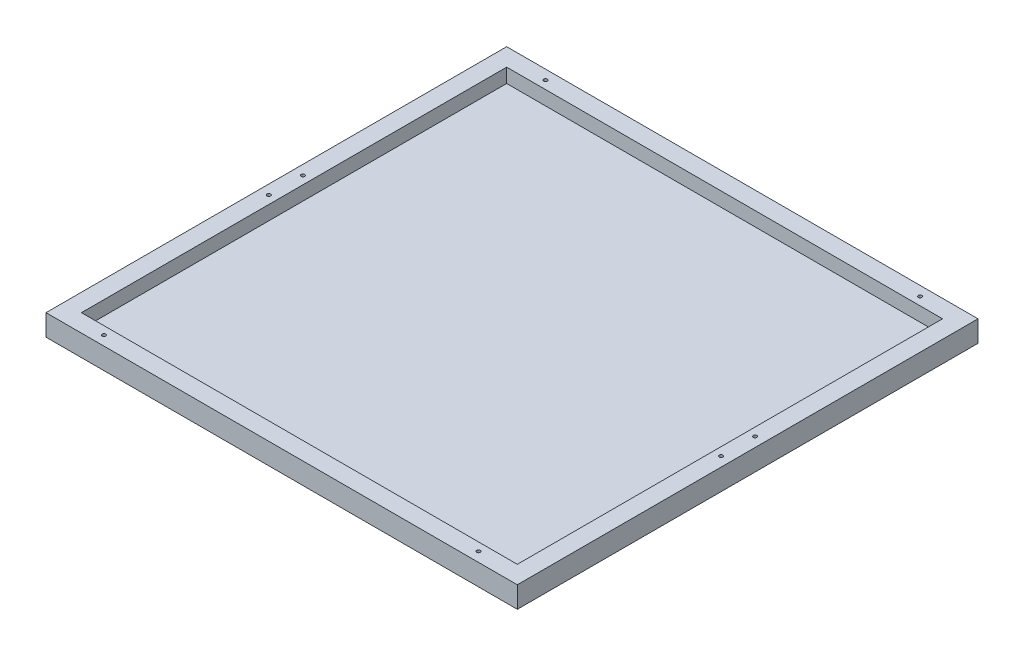
ISO-10303-21;
HEADER;
FILE_DESCRIPTION(('STEP AP214'),'2;1');
FILE_NAME('part.step','',(''),(''),'','','');
FILE_SCHEMA(('AUTOMOTIVE_DESIGN { 1 0 10303 214 1 1 1 1 }'));
ENDSEC;
DATA;
#1=APPLICATION_CONTEXT('core data for automotive mechanical design processes');
#2=APPLICATION_PROTOCOL_DEFINITION('international standard','automotive_design',2000,#1);
#3=PRODUCT_CONTEXT('',#1,'mechanical');
#4=PRODUCT('Part','Part','',(#3));
#5=PRODUCT_RELATED_PRODUCT_CATEGORY('part','',(#4));
#6=PRODUCT_DEFINITION_FORMATION('','',#4);
#7=PRODUCT_DEFINITION_CONTEXT('part definition',#1,'design');
#8=PRODUCT_DEFINITION('design','',#6,#7);
#9=PRODUCT_DEFINITION_SHAPE('','',#8);
#10=(LENGTH_UNIT() NAMED_UNIT(*) SI_UNIT(.MILLI.,.METRE.));
#11=(NAMED_UNIT(*) PLANE_ANGLE_UNIT() SI_UNIT($,.RADIAN.));
#12=(NAMED_UNIT(*) SI_UNIT($,.STERADIAN.) SOLID_ANGLE_UNIT());
#13=UNCERTAINTY_MEASURE_WITH_UNIT(LENGTH_MEASURE(1.E-05),#10,'distance_accuracy_value','');
#14=(GEOMETRIC_REPRESENTATION_CONTEXT(3) GLOBAL_UNCERTAINTY_ASSIGNED_CONTEXT((#13)) GLOBAL_UNIT_ASSIGNED_CONTEXT((#10,
#11,#12)) REPRESENTATION_CONTEXT('',''));
#15=CARTESIAN_POINT('',(0.,0.,0.));
#16=DIRECTION('',(0.,0.,1.));
#17=DIRECTION('',(1.,0.,0.));
#18=AXIS2_PLACEMENT_3D('',#15,#16,#17);
#19=CARTESIAN_POINT('',(0.,-30.,0.));
#20=DIRECTION('',(-1.,0.,0.));
#21=DIRECTION('',(0.,0.,1.));
#22=AXIS2_PLACEMENT_3D('',#19,#20,#21);
#23=PLANE('',#22);
#24=DIRECTION('',(0.,0.,1.));
#25=VECTOR('',#24,1.);
#26=CARTESIAN_POINT('',(0.,0.,0.));
#27=LINE('',#26,#25);
#28=CARTESIAN_POINT('',(0.,0.,-650.));
#29=VERTEX_POINT('',#28);
#30=CARTESIAN_POINT('',(0.,0.,0.));
#31=VERTEX_POINT('',#30);
#32=EDGE_CURVE('E191',#29,#31,#27,.T.);
#33=ORIENTED_EDGE('',*,*,#32,.F.);
#34=DIRECTION('',(0.,1.,0.));
#35=VECTOR('',#34,1.);
#36=CARTESIAN_POINT('',(0.,-30.,-650.));
#37=LINE('',#36,#35);
#38=CARTESIAN_POINT('',(0.,-30.,-650.));
#39=VERTEX_POINT('',#38);
#40=EDGE_CURVE('E11',#39,#29,#37,.T.);
#41=ORIENTED_EDGE('',*,*,#40,.F.);
#42=DIRECTION('',(0.,0.,1.));
#43=VECTOR('',#42,1.);
#44=CARTESIAN_POINT('',(0.,-30.,0.));
#45=LINE('',#44,#43);
#46=CARTESIAN_POINT('',(0.,-30.,0.));
#47=VERTEX_POINT('',#46);
#48=EDGE_CURVE('E192',#39,#47,#45,.T.);
#49=ORIENTED_EDGE('',*,*,#48,.T.);
#50=DIRECTION('',(0.,1.,0.));
#51=VECTOR('',#50,1.);
#52=CARTESIAN_POINT('',(0.,-30.,0.));
#53=LINE('',#52,#51);
#54=EDGE_CURVE('E36',#47,#31,#53,.T.);
#55=ORIENTED_EDGE('',*,*,#54,.T.);
#56=EDGE_LOOP('',(#33,#41,#49,#55));
#57=FACE_BOUND('',#56,.T.);
#58=ADVANCED_FACE('F33',(#57),#23,.T.);
#59=CARTESIAN_POINT('',(0.,-30.,-650.));
#60=DIRECTION('',(0.,0.,-1.));
#61=DIRECTION('',(-1.,0.,0.));
#62=AXIS2_PLACEMENT_3D('',#59,#60,#61);
#63=PLANE('',#62);
#64=DIRECTION('',(-1.,0.,0.));
#65=VECTOR('',#64,1.);
#66=CARTESIAN_POINT('',(0.,0.,-650.));
#67=LINE('',#66,#65);
#68=CARTESIAN_POINT('',(665.,0.,-650.));
#69=VERTEX_POINT('',#68);
#70=EDGE_CURVE('E195',#69,#29,#67,.T.);
#71=ORIENTED_EDGE('',*,*,#70,.F.);
#72=DIRECTION('',(0.,1.,0.));
#73=VECTOR('',#72,1.);
#74=CARTESIAN_POINT('',(665.,-30.,-650.));
#75=LINE('',#74,#73);
#76=CARTESIAN_POINT('',(665.,-30.,-650.));
#77=VERTEX_POINT('',#76);
#78=EDGE_CURVE('E41',#77,#69,#75,.T.);
#79=ORIENTED_EDGE('',*,*,#78,.F.);
#80=DIRECTION('',(-1.,0.,0.));
#81=VECTOR('',#80,1.);
#82=CARTESIAN_POINT('',(0.,-30.,-650.));
#83=LINE('',#82,#81);
#84=EDGE_CURVE('E200',#77,#39,#83,.T.);
#85=ORIENTED_EDGE('',*,*,#84,.T.);
#86=ORIENTED_EDGE('',*,*,#40,.T.);
#87=EDGE_LOOP('',(#71,#79,#85,#86));
#88=FACE_BOUND('',#87,.T.);
#89=ADVANCED_FACE('F217',(#88),#63,.T.);
#90=CARTESIAN_POINT('',(665.,-30.,0.));
#91=DIRECTION('',(1.,0.,0.));
#92=DIRECTION('',(0.,0.,-1.));
#93=AXIS2_PLACEMENT_3D('',#90,#91,#92);
#94=PLANE('',#93);
#95=DIRECTION('',(0.,0.,-1.));
#96=VECTOR('',#95,1.);
#97=CARTESIAN_POINT('',(665.,0.,0.));
#98=LINE('',#97,#96);
#99=CARTESIAN_POINT('',(665.,0.,0.));
#100=VERTEX_POINT('',#99);
#101=EDGE_CURVE('E207',#100,#69,#98,.T.);
#102=ORIENTED_EDGE('',*,*,#101,.F.);
#103=DIRECTION('',(0.,1.,0.));
#104=VECTOR('',#103,1.);
#105=CARTESIAN_POINT('',(665.,-30.,0.));
#106=LINE('',#105,#104);
#107=CARTESIAN_POINT('',(665.,-30.,0.));
#108=VERTEX_POINT('',#107);
#109=EDGE_CURVE('E212',#108,#100,#106,.T.);
#110=ORIENTED_EDGE('',*,*,#109,.F.);
#111=DIRECTION('',(0.,0.,-1.));
#112=VECTOR('',#111,1.);
#113=CARTESIAN_POINT('',(665.,-30.,0.));
#114=LINE('',#113,#112);
#115=EDGE_CURVE('E197',#108,#77,#114,.T.);
#116=ORIENTED_EDGE('',*,*,#115,.T.);
#117=ORIENTED_EDGE('',*,*,#78,.T.);
#118=EDGE_LOOP('',(#102,#110,#116,#117));
#119=FACE_BOUND('',#118,.T.);
#120=ADVANCED_FACE('F221',(#119),#94,.T.);
#121=CARTESIAN_POINT('',(0.,-30.,0.));
#122=DIRECTION('',(0.,0.,1.));
#123=DIRECTION('',(1.,0.,0.));
#124=AXIS2_PLACEMENT_3D('',#121,#122,#123);
#125=PLANE('',#124);
#126=DIRECTION('',(1.,0.,0.));
#127=VECTOR('',#126,1.);
#128=CARTESIAN_POINT('',(0.,0.,0.));
#129=LINE('',#128,#127);
#130=EDGE_CURVE('E204',#31,#100,#129,.T.);
#131=ORIENTED_EDGE('',*,*,#130,.F.);
#132=ORIENTED_EDGE('',*,*,#54,.F.);
#133=DIRECTION('',(1.,0.,0.));
#134=VECTOR('',#133,1.);
#135=CARTESIAN_POINT('',(0.,-30.,0.));
#136=LINE('',#135,#134);
#137=EDGE_CURVE('E194',#47,#108,#136,.T.);
#138=ORIENTED_EDGE('',*,*,#137,.T.);
#139=ORIENTED_EDGE('',*,*,#109,.T.);
#140=EDGE_LOOP('',(#131,#132,#138,#139));
#141=FACE_BOUND('',#140,.T.);
#142=ADVANCED_FACE('F214',(#141),#125,.T.);
#143=CARTESIAN_POINT('',(0.,-30.,0.));
#144=DIRECTION('',(0.,-1.,0.));
#145=DIRECTION('',(0.,0.,-1.));
#146=AXIS2_PLACEMENT_3D('',#143,#144,#145);
#147=PLANE('',#146);
#148=ORIENTED_EDGE('',*,*,#48,.F.);
#149=ORIENTED_EDGE('',*,*,#84,.F.);
#150=ORIENTED_EDGE('',*,*,#115,.F.);
#151=ORIENTED_EDGE('',*,*,#137,.F.);
#152=EDGE_LOOP('',(#148,#149,#150,#151));
#153=FACE_BOUND('',#152,.T.);
#154=ADVANCED_FACE('F223',(#153),#147,.T.);
#155=CARTESIAN_POINT('',(0.,0.,0.));
#156=DIRECTION('',(0.,-1.,0.));
#157=DIRECTION('',(0.,0.,-1.));
#158=AXIS2_PLACEMENT_3D('',#155,#156,#157);
#159=PLANE('',#158);
#160=DIRECTION('',(1.,0.,0.));
#161=VECTOR('',#160,1.);
#162=CARTESIAN_POINT('',(25.0000000000001,0.,-25.));
#163=LINE('',#162,#161);
#164=CARTESIAN_POINT('',(25.0000000000001,0.,-25.));
#165=VERTEX_POINT('',#164);
#166=CARTESIAN_POINT('',(640.,0.,-25.));
#167=VERTEX_POINT('',#166);
#168=EDGE_CURVE('E134',#165,#167,#163,.T.);
#169=ORIENTED_EDGE('',*,*,#168,.F.);
#170=DIRECTION('',(0.,0.,1.));
#171=VECTOR('',#170,1.);
#172=CARTESIAN_POINT('',(25.,0.,-625.));
#173=LINE('',#172,#171);
#174=CARTESIAN_POINT('',(25.,0.,-625.));
#175=VERTEX_POINT('',#174);
#176=EDGE_CURVE('E49',#175,#165,#173,.T.);
#177=ORIENTED_EDGE('',*,*,#176,.F.);
#178=DIRECTION('',(-1.,0.,0.));
#179=VECTOR('',#178,1.);
#180=CARTESIAN_POINT('',(25.,0.,-625.));
#181=LINE('',#180,#179);
#182=CARTESIAN_POINT('',(640.,0.,-625.));
#183=VERTEX_POINT('',#182);
#184=EDGE_CURVE('E125',#183,#175,#181,.T.);
#185=ORIENTED_EDGE('',*,*,#184,.F.);
#186=DIRECTION('',(0.,0.,-1.));
#187=VECTOR('',#186,1.);
#188=CARTESIAN_POINT('',(640.,0.,-625.));
#189=LINE('',#188,#187);
#190=EDGE_CURVE('E128',#167,#183,#189,.T.);
#191=ORIENTED_EDGE('',*,*,#190,.F.);
#192=EDGE_LOOP('',(#169,#177,#185,#191));
#193=FACE_BOUND('',#192,.T.);
#194=CARTESIAN_POINT('',(68.25,0.,-13.5));
#195=DIRECTION('',(0.,1.,0.));
#196=DIRECTION('',(0.,0.,1.));
#197=AXIS2_PLACEMENT_3D('',#194,#195,#196);
#198=CIRCLE('',#197,2.5273);
#199=CARTESIAN_POINT('',(68.25,0.,-10.9727));
#200=VERTEX_POINT('',#199);
#201=EDGE_CURVE('E140',#200,#200,#198,.T.);
#202=ORIENTED_EDGE('',*,*,#201,.F.);
#203=EDGE_LOOP('',(#202));
#204=FACE_BOUND('',#203,.T.);
#205=CARTESIAN_POINT('',(13.5,0.,-301.));
#206=DIRECTION('',(0.,1.,0.));
#207=DIRECTION('',(0.,0.,1.));
#208=AXIS2_PLACEMENT_3D('',#205,#206,#207);
#209=CIRCLE('',#208,2.5273);
#210=CARTESIAN_POINT('',(13.5,0.,-298.4727));
#211=VERTEX_POINT('',#210);
#212=EDGE_CURVE('E149',#211,#211,#209,.T.);
#213=ORIENTED_EDGE('',*,*,#212,.F.);
#214=EDGE_LOOP('',(#213));
#215=FACE_BOUND('',#214,.T.);
#216=CARTESIAN_POINT('',(596.75,0.,-13.5));
#217=DIRECTION('',(0.,1.,0.));
#218=DIRECTION('',(0.,0.,1.));
#219=AXIS2_PLACEMENT_3D('',#216,#217,#218);
#220=CIRCLE('',#219,2.52730000000001);
#221=CARTESIAN_POINT('',(596.75,0.,-10.9726999999999));
#222=VERTEX_POINT('',#221);
#223=EDGE_CURVE('E155',#222,#222,#220,.T.);
#224=ORIENTED_EDGE('',*,*,#223,.F.);
#225=EDGE_LOOP('',(#224));
#226=FACE_BOUND('',#225,.T.);
#227=CARTESIAN_POINT('',(651.5,0.,-301.));
#228=DIRECTION('',(0.,1.,0.));
#229=DIRECTION('',(0.,0.,1.));
#230=AXIS2_PLACEMENT_3D('',#227,#228,#229);
#231=CIRCLE('',#230,2.52730000000001);
#232=CARTESIAN_POINT('',(651.5,0.,-298.4727));
#233=VERTEX_POINT('',#232);
#234=EDGE_CURVE('E161',#233,#233,#231,.T.);
#235=ORIENTED_EDGE('',*,*,#234,.F.);
#236=EDGE_LOOP('',(#235));
#237=FACE_BOUND('',#236,.T.);
#238=CARTESIAN_POINT('',(651.5,0.,-349.));
#239=DIRECTION('',(0.,1.,0.));
#240=DIRECTION('',(0.,0.,1.));
#241=AXIS2_PLACEMENT_3D('',#238,#239,#240);
#242=CIRCLE('',#241,2.52730000000001);
#243=CARTESIAN_POINT('',(651.5,0.,-346.4727));
#244=VERTEX_POINT('',#243);
#245=EDGE_CURVE('E167',#244,#244,#242,.T.);
#246=ORIENTED_EDGE('',*,*,#245,.F.);
#247=EDGE_LOOP('',(#246));
#248=FACE_BOUND('',#247,.T.);
#249=CARTESIAN_POINT('',(596.75,0.,-636.5));
#250=DIRECTION('',(0.,1.,0.));
#251=DIRECTION('',(0.,0.,1.));
#252=AXIS2_PLACEMENT_3D('',#249,#250,#251);
#253=CIRCLE('',#252,2.52730000000001);
#254=CARTESIAN_POINT('',(596.75,0.,-633.9727));
#255=VERTEX_POINT('',#254);
#256=EDGE_CURVE('E173',#255,#255,#253,.T.);
#257=ORIENTED_EDGE('',*,*,#256,.F.);
#258=EDGE_LOOP('',(#257));
#259=FACE_BOUND('',#258,.T.);
#260=CARTESIAN_POINT('',(68.25,0.,-636.5));
#261=DIRECTION('',(0.,1.,0.));
#262=DIRECTION('',(0.,0.,1.));
#263=AXIS2_PLACEMENT_3D('',#260,#261,#262);
#264=CIRCLE('',#263,2.5273);
#265=CARTESIAN_POINT('',(68.25,0.,-633.9727));
#266=VERTEX_POINT('',#265);
#267=EDGE_CURVE('E179',#266,#266,#264,.T.);
#268=ORIENTED_EDGE('',*,*,#267,.F.);
#269=EDGE_LOOP('',(#268));
#270=FACE_BOUND('',#269,.T.);
#271=CARTESIAN_POINT('',(13.5000000000001,0.,-349.));
#272=DIRECTION('',(0.,1.,0.));
#273=DIRECTION('',(0.,0.,1.));
#274=AXIS2_PLACEMENT_3D('',#271,#272,#273);
#275=CIRCLE('',#274,2.5273);
#276=CARTESIAN_POINT('',(13.5000000000001,0.,-346.4727));
#277=VERTEX_POINT('',#276);
#278=EDGE_CURVE('E185',#277,#277,#275,.T.);
#279=ORIENTED_EDGE('',*,*,#278,.F.);
#280=EDGE_LOOP('',(#279));
#281=FACE_BOUND('',#280,.T.);
#282=ORIENTED_EDGE('',*,*,#32,.T.);
#283=ORIENTED_EDGE('',*,*,#130,.T.);
#284=ORIENTED_EDGE('',*,*,#101,.T.);
#285=ORIENTED_EDGE('',*,*,#70,.T.);
#286=EDGE_LOOP('',(#282,#283,#284,#285));
#287=FACE_BOUND('',#286,.T.);
#288=ADVANCED_FACE('F216',(#193,#204,#215,#226,#237,#248,#259,#270,#281,#287),#159,.F.);
#289=CARTESIAN_POINT('',(13.5000000000001,-9.65,-349.));
#290=DIRECTION('',(0.,-1.,0.));
#291=DIRECTION('',(0.,0.,-1.));
#292=AXIS2_PLACEMENT_3D('',#289,#290,#291);
#293=PLANE('',#292);
#294=CARTESIAN_POINT('',(13.5000000000001,-9.65,-349.));
#295=DIRECTION('',(0.,1.,0.));
#296=DIRECTION('',(0.,0.,1.));
#297=AXIS2_PLACEMENT_3D('',#294,#295,#296);
#298=CIRCLE('',#297,2.5273);
#299=CARTESIAN_POINT('',(13.5000000000001,-9.65,-346.4727));
#300=VERTEX_POINT('',#299);
#301=EDGE_CURVE('E188',#300,#300,#298,.T.);
#302=ORIENTED_EDGE('',*,*,#301,.T.);
#303=EDGE_LOOP('',(#302));
#304=FACE_BOUND('',#303,.T.);
#305=ADVANCED_FACE('F231',(#304),#293,.F.);
#306=CARTESIAN_POINT('',(13.5000000000001,0.,-349.));
#307=DIRECTION('',(0.,1.,0.));
#308=DIRECTION('',(0.,0.,1.));
#309=AXIS2_PLACEMENT_3D('',#306,#307,#308);
#310=CYLINDRICAL_SURFACE('',#309,2.5273);
#311=ORIENTED_EDGE('',*,*,#301,.F.);
#312=EDGE_LOOP('',(#311));
#313=FACE_BOUND('',#312,.T.);
#314=ORIENTED_EDGE('',*,*,#278,.T.);
#315=EDGE_LOOP('',(#314));
#316=FACE_BOUND('',#315,.T.);
#317=ADVANCED_FACE('F264',(#313,#316),#310,.F.);
#318=CARTESIAN_POINT('',(68.25,-9.65,-636.5));
#319=DIRECTION('',(0.,-1.,0.));
#320=DIRECTION('',(0.,0.,-1.));
#321=AXIS2_PLACEMENT_3D('',#318,#319,#320);
#322=PLANE('',#321);
#323=CARTESIAN_POINT('',(68.25,-9.65,-636.5));
#324=DIRECTION('',(0.,1.,0.));
#325=DIRECTION('',(0.,0.,1.));
#326=AXIS2_PLACEMENT_3D('',#323,#324,#325);
#327=CIRCLE('',#326,2.5273);
#328=CARTESIAN_POINT('',(68.25,-9.65,-633.9727));
#329=VERTEX_POINT('',#328);
#330=EDGE_CURVE('E182',#329,#329,#327,.T.);
#331=ORIENTED_EDGE('',*,*,#330,.T.);
#332=EDGE_LOOP('',(#331));
#333=FACE_BOUND('',#332,.T.);
#334=ADVANCED_FACE('F273',(#333),#322,.F.);
#335=CARTESIAN_POINT('',(68.25,0.,-636.5));
#336=DIRECTION('',(0.,1.,0.));
#337=DIRECTION('',(0.,0.,1.));
#338=AXIS2_PLACEMENT_3D('',#335,#336,#337);
#339=CYLINDRICAL_SURFACE('',#338,2.5273);
#340=ORIENTED_EDGE('',*,*,#330,.F.);
#341=EDGE_LOOP('',(#340));
#342=FACE_BOUND('',#341,.T.);
#343=ORIENTED_EDGE('',*,*,#267,.T.);
#344=EDGE_LOOP('',(#343));
#345=FACE_BOUND('',#344,.T.);
#346=ADVANCED_FACE('F283',(#342,#345),#339,.F.);
#347=CARTESIAN_POINT('',(596.75,-9.65,-636.5));
#348=DIRECTION('',(0.,-1.,0.));
#349=DIRECTION('',(0.,0.,-1.));
#350=AXIS2_PLACEMENT_3D('',#347,#348,#349);
#351=PLANE('',#350);
#352=CARTESIAN_POINT('',(596.75,-9.65,-636.5));
#353=DIRECTION('',(0.,1.,0.));
#354=DIRECTION('',(0.,0.,1.));
#355=AXIS2_PLACEMENT_3D('',#352,#353,#354);
#356=CIRCLE('',#355,2.52730000000001);
#357=CARTESIAN_POINT('',(596.75,-9.65,-633.9727));
#358=VERTEX_POINT('',#357);
#359=EDGE_CURVE('E176',#358,#358,#356,.T.);
#360=ORIENTED_EDGE('',*,*,#359,.T.);
#361=EDGE_LOOP('',(#360));
#362=FACE_BOUND('',#361,.T.);
#363=ADVANCED_FACE('F293',(#362),#351,.F.);
#364=CARTESIAN_POINT('',(596.75,0.,-636.5));
#365=DIRECTION('',(0.,1.,0.));
#366=DIRECTION('',(0.,0.,1.));
#367=AXIS2_PLACEMENT_3D('',#364,#365,#366);
#368=CYLINDRICAL_SURFACE('',#367,2.52730000000001);
#369=ORIENTED_EDGE('',*,*,#359,.F.);
#370=EDGE_LOOP('',(#369));
#371=FACE_BOUND('',#370,.T.);
#372=ORIENTED_EDGE('',*,*,#256,.T.);
#373=EDGE_LOOP('',(#372));
#374=FACE_BOUND('',#373,.T.);
#375=ADVANCED_FACE('F303',(#371,#374),#368,.F.);
#376=CARTESIAN_POINT('',(651.5,-9.65,-349.));
#377=DIRECTION('',(0.,-1.,0.));
#378=DIRECTION('',(0.,0.,-1.));
#379=AXIS2_PLACEMENT_3D('',#376,#377,#378);
#380=PLANE('',#379);
#381=CARTESIAN_POINT('',(651.5,-9.65,-349.));
#382=DIRECTION('',(0.,1.,0.));
#383=DIRECTION('',(0.,0.,1.));
#384=AXIS2_PLACEMENT_3D('',#381,#382,#383);
#385=CIRCLE('',#384,2.52730000000001);
#386=CARTESIAN_POINT('',(651.5,-9.65,-346.4727));
#387=VERTEX_POINT('',#386);
#388=EDGE_CURVE('E170',#387,#387,#385,.T.);
#389=ORIENTED_EDGE('',*,*,#388,.T.);
#390=EDGE_LOOP('',(#389));
#391=FACE_BOUND('',#390,.T.);
#392=ADVANCED_FACE('F313',(#391),#380,.F.);
#393=CARTESIAN_POINT('',(651.5,0.,-349.));
#394=DIRECTION('',(0.,1.,0.));
#395=DIRECTION('',(0.,0.,1.));
#396=AXIS2_PLACEMENT_3D('',#393,#394,#395);
#397=CYLINDRICAL_SURFACE('',#396,2.52730000000001);
#398=ORIENTED_EDGE('',*,*,#388,.F.);
#399=EDGE_LOOP('',(#398));
#400=FACE_BOUND('',#399,.T.);
#401=ORIENTED_EDGE('',*,*,#245,.T.);
#402=EDGE_LOOP('',(#401));
#403=FACE_BOUND('',#402,.T.);
#404=ADVANCED_FACE('F323',(#400,#403),#397,.F.);
#405=CARTESIAN_POINT('',(651.5,-9.65,-301.));
#406=DIRECTION('',(0.,-1.,0.));
#407=DIRECTION('',(0.,0.,-1.));
#408=AXIS2_PLACEMENT_3D('',#405,#406,#407);
#409=PLANE('',#408);
#410=CARTESIAN_POINT('',(651.5,-9.65,-301.));
#411=DIRECTION('',(0.,1.,0.));
#412=DIRECTION('',(0.,0.,1.));
#413=AXIS2_PLACEMENT_3D('',#410,#411,#412);
#414=CIRCLE('',#413,2.52730000000001);
#415=CARTESIAN_POINT('',(651.5,-9.65,-298.4727));
#416=VERTEX_POINT('',#415);
#417=EDGE_CURVE('E164',#416,#416,#414,.T.);
#418=ORIENTED_EDGE('',*,*,#417,.T.);
#419=EDGE_LOOP('',(#418));
#420=FACE_BOUND('',#419,.T.);
#421=ADVANCED_FACE('F333',(#420),#409,.F.);
#422=CARTESIAN_POINT('',(651.5,0.,-301.));
#423=DIRECTION('',(0.,1.,0.));
#424=DIRECTION('',(0.,0.,1.));
#425=AXIS2_PLACEMENT_3D('',#422,#423,#424);
#426=CYLINDRICAL_SURFACE('',#425,2.52730000000001);
#427=ORIENTED_EDGE('',*,*,#417,.F.);
#428=EDGE_LOOP('',(#427));
#429=FACE_BOUND('',#428,.T.);
#430=ORIENTED_EDGE('',*,*,#234,.T.);
#431=EDGE_LOOP('',(#430));
#432=FACE_BOUND('',#431,.T.);
#433=ADVANCED_FACE('F343',(#429,#432),#426,.F.);
#434=CARTESIAN_POINT('',(596.75,-9.65,-13.5));
#435=DIRECTION('',(0.,-1.,0.));
#436=DIRECTION('',(0.,0.,-1.));
#437=AXIS2_PLACEMENT_3D('',#434,#435,#436);
#438=PLANE('',#437);
#439=CARTESIAN_POINT('',(596.75,-9.65,-13.5));
#440=DIRECTION('',(0.,1.,0.));
#441=DIRECTION('',(0.,0.,1.));
#442=AXIS2_PLACEMENT_3D('',#439,#440,#441);
#443=CIRCLE('',#442,2.52730000000001);
#444=CARTESIAN_POINT('',(596.75,-9.65,-10.9726999999999));
#445=VERTEX_POINT('',#444);
#446=EDGE_CURVE('E158',#445,#445,#443,.T.);
#447=ORIENTED_EDGE('',*,*,#446,.T.);
#448=EDGE_LOOP('',(#447));
#449=FACE_BOUND('',#448,.T.);
#450=ADVANCED_FACE('F353',(#449),#438,.F.);
#451=CARTESIAN_POINT('',(596.75,0.,-13.5));
#452=DIRECTION('',(0.,1.,0.));
#453=DIRECTION('',(0.,0.,1.));
#454=AXIS2_PLACEMENT_3D('',#451,#452,#453);
#455=CYLINDRICAL_SURFACE('',#454,2.52730000000001);
#456=ORIENTED_EDGE('',*,*,#446,.F.);
#457=EDGE_LOOP('',(#456));
#458=FACE_BOUND('',#457,.T.);
#459=ORIENTED_EDGE('',*,*,#223,.T.);
#460=EDGE_LOOP('',(#459));
#461=FACE_BOUND('',#460,.T.);
#462=ADVANCED_FACE('F363',(#458,#461),#455,.F.);
#463=CARTESIAN_POINT('',(13.5,-9.65,-301.));
#464=DIRECTION('',(0.,-1.,0.));
#465=DIRECTION('',(0.,0.,-1.));
#466=AXIS2_PLACEMENT_3D('',#463,#464,#465);
#467=PLANE('',#466);
#468=CARTESIAN_POINT('',(13.5,-9.65,-301.));
#469=DIRECTION('',(0.,1.,0.));
#470=DIRECTION('',(0.,0.,1.));
#471=AXIS2_PLACEMENT_3D('',#468,#469,#470);
#472=CIRCLE('',#471,2.5273);
#473=CARTESIAN_POINT('',(13.5,-9.65,-298.4727));
#474=VERTEX_POINT('',#473);
#475=EDGE_CURVE('E152',#474,#474,#472,.T.);
#476=ORIENTED_EDGE('',*,*,#475,.T.);
#477=EDGE_LOOP('',(#476));
#478=FACE_BOUND('',#477,.T.);
#479=ADVANCED_FACE('F373',(#478),#467,.F.);
#480=CARTESIAN_POINT('',(13.5,0.,-301.));
#481=DIRECTION('',(0.,1.,0.));
#482=DIRECTION('',(0.,0.,1.));
#483=AXIS2_PLACEMENT_3D('',#480,#481,#482);
#484=CYLINDRICAL_SURFACE('',#483,2.5273);
#485=ORIENTED_EDGE('',*,*,#475,.F.);
#486=EDGE_LOOP('',(#485));
#487=FACE_BOUND('',#486,.T.);
#488=ORIENTED_EDGE('',*,*,#212,.T.);
#489=EDGE_LOOP('',(#488));
#490=FACE_BOUND('',#489,.T.);
#491=ADVANCED_FACE('F383',(#487,#490),#484,.F.);
#492=CARTESIAN_POINT('',(68.25,-9.65,-13.5));
#493=DIRECTION('',(0.,-1.,0.));
#494=DIRECTION('',(0.,0.,-1.));
#495=AXIS2_PLACEMENT_3D('',#492,#493,#494);
#496=PLANE('',#495);
#497=CARTESIAN_POINT('',(68.25,-9.65,-13.5));
#498=DIRECTION('',(0.,1.,0.));
#499=DIRECTION('',(0.,0.,1.));
#500=AXIS2_PLACEMENT_3D('',#497,#498,#499);
#501=CIRCLE('',#500,2.5273);
#502=CARTESIAN_POINT('',(68.25,-9.65,-10.9727));
#503=VERTEX_POINT('',#502);
#504=EDGE_CURVE('E146',#503,#503,#501,.T.);
#505=ORIENTED_EDGE('',*,*,#504,.T.);
#506=EDGE_LOOP('',(#505));
#507=FACE_BOUND('',#506,.T.);
#508=ADVANCED_FACE('F393',(#507),#496,.F.);
#509=CARTESIAN_POINT('',(68.25,0.,-13.5));
#510=DIRECTION('',(0.,1.,0.));
#511=DIRECTION('',(0.,0.,1.));
#512=AXIS2_PLACEMENT_3D('',#509,#510,#511);
#513=CYLINDRICAL_SURFACE('',#512,2.5273);
#514=ORIENTED_EDGE('',*,*,#504,.F.);
#515=EDGE_LOOP('',(#514));
#516=FACE_BOUND('',#515,.T.);
#517=ORIENTED_EDGE('',*,*,#201,.T.);
#518=EDGE_LOOP('',(#517));
#519=FACE_BOUND('',#518,.T.);
#520=ADVANCED_FACE('F403',(#516,#519),#513,.F.);
#521=CARTESIAN_POINT('',(25.,-20.,-625.));
#522=DIRECTION('',(-1.,0.,0.));
#523=DIRECTION('',(0.,0.,1.));
#524=AXIS2_PLACEMENT_3D('',#521,#522,#523);
#525=PLANE('',#524);
#526=ORIENTED_EDGE('',*,*,#176,.T.);
#527=DIRECTION('',(0.,1.,0.));
#528=VECTOR('',#527,1.);
#529=CARTESIAN_POINT('',(25.0000000000001,-20.,-25.));
#530=LINE('',#529,#528);
#531=CARTESIAN_POINT('',(25.0000000000001,-20.,-25.));
#532=VERTEX_POINT('',#531);
#533=EDGE_CURVE('E103',#532,#165,#530,.T.);
#534=ORIENTED_EDGE('',*,*,#533,.F.);
#535=DIRECTION('',(0.,0.,1.));
#536=VECTOR('',#535,1.);
#537=CARTESIAN_POINT('',(25.,-20.,-625.));
#538=LINE('',#537,#536);
#539=CARTESIAN_POINT('',(25.,-20.,-625.));
#540=VERTEX_POINT('',#539);
#541=EDGE_CURVE('E107',#540,#532,#538,.T.);
#542=ORIENTED_EDGE('',*,*,#541,.F.);
#543=DIRECTION('',(0.,1.,0.));
#544=VECTOR('',#543,1.);
#545=CARTESIAN_POINT('',(25.,-20.,-625.));
#546=LINE('',#545,#544);
#547=EDGE_CURVE('E138',#540,#175,#546,.T.);
#548=ORIENTED_EDGE('',*,*,#547,.T.);
#549=EDGE_LOOP('',(#526,#534,#542,#548));
#550=FACE_BOUND('',#549,.T.);
#551=ADVANCED_FACE('F105',(#550),#525,.F.);
#552=CARTESIAN_POINT('',(25.,-20.,-625.));
#553=DIRECTION('',(0.,0.,-1.));
#554=DIRECTION('',(-1.,0.,0.));
#555=AXIS2_PLACEMENT_3D('',#552,#553,#554);
#556=PLANE('',#555);
#557=ORIENTED_EDGE('',*,*,#184,.T.);
#558=ORIENTED_EDGE('',*,*,#547,.F.);
#559=DIRECTION('',(-1.,0.,0.));
#560=VECTOR('',#559,1.);
#561=CARTESIAN_POINT('',(25.,-20.,-625.));
#562=LINE('',#561,#560);
#563=CARTESIAN_POINT('',(640.,-20.,-625.));
#564=VERTEX_POINT('',#563);
#565=EDGE_CURVE('E113',#564,#540,#562,.T.);
#566=ORIENTED_EDGE('',*,*,#565,.F.);
#567=DIRECTION('',(0.,1.,0.));
#568=VECTOR('',#567,1.);
#569=CARTESIAN_POINT('',(640.,-20.,-625.));
#570=LINE('',#569,#568);
#571=EDGE_CURVE('E141',#564,#183,#570,.T.);
#572=ORIENTED_EDGE('',*,*,#571,.T.);
#573=EDGE_LOOP('',(#557,#558,#566,#572));
#574=FACE_BOUND('',#573,.T.);
#575=ADVANCED_FACE('F424',(#574),#556,.F.);
#576=CARTESIAN_POINT('',(640.,-20.,-625.));
#577=DIRECTION('',(1.,0.,0.));
#578=DIRECTION('',(0.,0.,-1.));
#579=AXIS2_PLACEMENT_3D('',#576,#577,#578);
#580=PLANE('',#579);
#581=ORIENTED_EDGE('',*,*,#190,.T.);
#582=ORIENTED_EDGE('',*,*,#571,.F.);
#583=DIRECTION('',(0.,0.,-1.));
#584=VECTOR('',#583,1.);
#585=CARTESIAN_POINT('',(640.,-20.,-625.));
#586=LINE('',#585,#584);
#587=CARTESIAN_POINT('',(640.,-20.,-25.));
#588=VERTEX_POINT('',#587);
#589=EDGE_CURVE('E121',#588,#564,#586,.T.);
#590=ORIENTED_EDGE('',*,*,#589,.F.);
#591=DIRECTION('',(0.,1.,0.));
#592=VECTOR('',#591,1.);
#593=CARTESIAN_POINT('',(640.,-20.,-25.));
#594=LINE('',#593,#592);
#595=EDGE_CURVE('E112',#588,#167,#594,.T.);
#596=ORIENTED_EDGE('',*,*,#595,.T.);
#597=EDGE_LOOP('',(#581,#582,#590,#596));
#598=FACE_BOUND('',#597,.T.);
#599=ADVANCED_FACE('F433',(#598),#580,.F.);
#600=CARTESIAN_POINT('',(25.0000000000001,-20.,-25.));
#601=DIRECTION('',(0.,0.,1.));
#602=DIRECTION('',(1.,0.,0.));
#603=AXIS2_PLACEMENT_3D('',#600,#601,#602);
#604=PLANE('',#603);
#605=ORIENTED_EDGE('',*,*,#168,.T.);
#606=ORIENTED_EDGE('',*,*,#595,.F.);
#607=DIRECTION('',(1.,0.,0.));
#608=VECTOR('',#607,1.);
#609=CARTESIAN_POINT('',(25.0000000000001,-20.,-25.));
#610=LINE('',#609,#608);
#611=EDGE_CURVE('E116',#532,#588,#610,.T.);
#612=ORIENTED_EDGE('',*,*,#611,.F.);
#613=ORIENTED_EDGE('',*,*,#533,.T.);
#614=EDGE_LOOP('',(#605,#606,#612,#613));
#615=FACE_BOUND('',#614,.T.);
#616=ADVANCED_FACE('F117',(#615),#604,.F.);
#617=CARTESIAN_POINT('',(0.,-20.,0.));
#618=DIRECTION('',(0.,1.,0.));
#619=DIRECTION('',(0.,0.,1.));
#620=AXIS2_PLACEMENT_3D('',#617,#618,#619);
#621=PLANE('',#620);
#622=ORIENTED_EDGE('',*,*,#541,.T.);
#623=ORIENTED_EDGE('',*,*,#611,.T.);
#624=ORIENTED_EDGE('',*,*,#589,.T.);
#625=ORIENTED_EDGE('',*,*,#565,.T.);
#626=EDGE_LOOP('',(#622,#623,#624,#625));
#627=FACE_BOUND('',#626,.T.);
#628=ADVANCED_FACE('F123',(#627),#621,.T.);
#629=CLOSED_SHELL('',(#58,#89,#120,#142,#154,#288,#305,#317,#334,#346,#363,#375,#392,#404,#421,
#433,#450,#462,#479,#491,#508,#520,#551,#575,#599,#616,#628));
#630=MANIFOLD_SOLID_BREP('B2',#629);
#631=ADVANCED_BREP_SHAPE_REPRESENTATION('',(#18,#630),#14);
#632=SHAPE_DEFINITION_REPRESENTATION(#9,#631);
ENDSEC;
END-ISO-10303-21;
